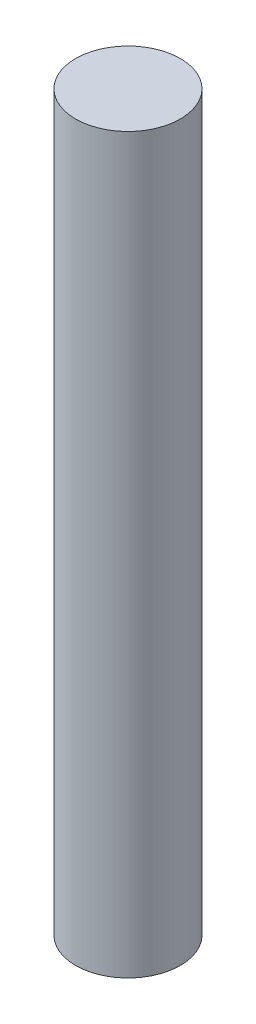
ISO-10303-21;
HEADER;
FILE_DESCRIPTION(('STEP AP214'),'2;1');
FILE_NAME('part.step','',(''),(''),'','','');
FILE_SCHEMA(('AUTOMOTIVE_DESIGN { 1 0 10303 214 1 1 1 1 }'));
ENDSEC;
DATA;
#1=APPLICATION_CONTEXT('core data for automotive mechanical design processes');
#2=APPLICATION_PROTOCOL_DEFINITION('international standard','automotive_design',2000,#1);
#3=PRODUCT_CONTEXT('',#1,'mechanical');
#4=PRODUCT('Part','Part','',(#3));
#5=PRODUCT_RELATED_PRODUCT_CATEGORY('part','',(#4));
#6=PRODUCT_DEFINITION_FORMATION('','',#4);
#7=PRODUCT_DEFINITION_CONTEXT('part definition',#1,'design');
#8=PRODUCT_DEFINITION('design','',#6,#7);
#9=PRODUCT_DEFINITION_SHAPE('','',#8);
#10=(LENGTH_UNIT() NAMED_UNIT(*) SI_UNIT(.MILLI.,.METRE.));
#11=(NAMED_UNIT(*) PLANE_ANGLE_UNIT() SI_UNIT($,.RADIAN.));
#12=(NAMED_UNIT(*) SI_UNIT($,.STERADIAN.) SOLID_ANGLE_UNIT());
#13=UNCERTAINTY_MEASURE_WITH_UNIT(LENGTH_MEASURE(1.E-05),#10,'distance_accuracy_value','');
#14=(GEOMETRIC_REPRESENTATION_CONTEXT(3) GLOBAL_UNCERTAINTY_ASSIGNED_CONTEXT((#13)) GLOBAL_UNIT_ASSIGNED_CONTEXT((#10,
#11,#12)) REPRESENTATION_CONTEXT('',''));
#15=CARTESIAN_POINT('',(0.,0.,0.));
#16=DIRECTION('',(0.,0.,1.));
#17=DIRECTION('',(1.,0.,0.));
#18=AXIS2_PLACEMENT_3D('',#15,#16,#17);
#19=CARTESIAN_POINT('',(0.,21.,0.));
#20=DIRECTION('',(0.,-1.,0.));
#21=DIRECTION('',(0.,0.,-1.));
#22=AXIS2_PLACEMENT_3D('',#19,#20,#21);
#23=CYLINDRICAL_SURFACE('',#22,1.5);
#24=CARTESIAN_POINT('',(0.,21.,0.));
#25=DIRECTION('',(0.,1.,0.));
#26=DIRECTION('',(0.,0.,1.));
#27=AXIS2_PLACEMENT_3D('',#24,#25,#26);
#28=CIRCLE('',#27,1.5);
#29=CARTESIAN_POINT('',(0.,21.,1.5));
#30=VERTEX_POINT('',#29);
#31=EDGE_CURVE('E10',#30,#30,#28,.T.);
#32=ORIENTED_EDGE('',*,*,#31,.F.);
#33=EDGE_LOOP('',(#32));
#34=FACE_BOUND('',#33,.T.);
#35=CARTESIAN_POINT('',(0.,0.,0.));
#36=DIRECTION('',(0.,1.,0.));
#37=DIRECTION('',(0.,0.,1.));
#38=AXIS2_PLACEMENT_3D('',#35,#36,#37);
#39=CIRCLE('',#38,1.5);
#40=CARTESIAN_POINT('',(0.,0.,1.5));
#41=VERTEX_POINT('',#40);
#42=EDGE_CURVE('E44',#41,#41,#39,.T.);
#43=ORIENTED_EDGE('',*,*,#42,.T.);
#44=EDGE_LOOP('',(#43));
#45=FACE_BOUND('',#44,.T.);
#46=ADVANCED_FACE('F41',(#34,#45),#23,.T.);
#47=CARTESIAN_POINT('',(0.,21.,0.));
#48=DIRECTION('',(0.,1.,0.));
#49=DIRECTION('',(0.,0.,1.));
#50=AXIS2_PLACEMENT_3D('',#47,#48,#49);
#51=PLANE('',#50);
#52=ORIENTED_EDGE('',*,*,#31,.T.);
#53=EDGE_LOOP('',(#52));
#54=FACE_BOUND('',#53,.T.);
#55=ADVANCED_FACE('F58',(#54),#51,.T.);
#56=CARTESIAN_POINT('',(0.,0.,0.));
#57=DIRECTION('',(0.,1.,0.));
#58=DIRECTION('',(0.,0.,1.));
#59=AXIS2_PLACEMENT_3D('',#56,#57,#58);
#60=PLANE('',#59);
#61=ORIENTED_EDGE('',*,*,#42,.F.);
#62=EDGE_LOOP('',(#61));
#63=FACE_BOUND('',#62,.T.);
#64=ADVANCED_FACE('F56',(#63),#60,.F.);
#65=CLOSED_SHELL('',(#46,#55,#64));
#66=MANIFOLD_SOLID_BREP('B2',#65);
#67=ADVANCED_BREP_SHAPE_REPRESENTATION('',(#18,#66),#14);
#68=SHAPE_DEFINITION_REPRESENTATION(#9,#67);
ENDSEC;
END-ISO-10303-21;
